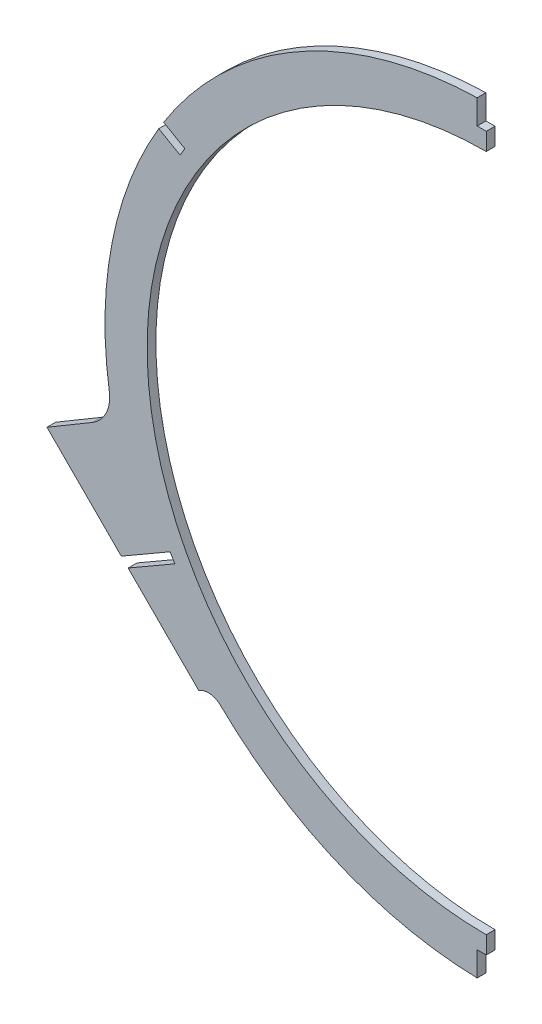
ISO-10303-21;
HEADER;
FILE_DESCRIPTION(('STEP AP214'),'2;1');
FILE_NAME('part.step','',(''),(''),'','','');
FILE_SCHEMA(('AUTOMOTIVE_DESIGN { 1 0 10303 214 1 1 1 1 }'));
ENDSEC;
DATA;
#1=APPLICATION_CONTEXT('core data for automotive mechanical design processes');
#2=APPLICATION_PROTOCOL_DEFINITION('international standard','automotive_design',2000,#1);
#3=PRODUCT_CONTEXT('',#1,'mechanical');
#4=PRODUCT('Part','Part','',(#3));
#5=PRODUCT_RELATED_PRODUCT_CATEGORY('part','',(#4));
#6=PRODUCT_DEFINITION_FORMATION('','',#4);
#7=PRODUCT_DEFINITION_CONTEXT('part definition',#1,'design');
#8=PRODUCT_DEFINITION('design','',#6,#7);
#9=PRODUCT_DEFINITION_SHAPE('','',#8);
#10=(LENGTH_UNIT() NAMED_UNIT(*) SI_UNIT(.MILLI.,.METRE.));
#11=(NAMED_UNIT(*) PLANE_ANGLE_UNIT() SI_UNIT($,.RADIAN.));
#12=(NAMED_UNIT(*) SI_UNIT($,.STERADIAN.) SOLID_ANGLE_UNIT());
#13=UNCERTAINTY_MEASURE_WITH_UNIT(LENGTH_MEASURE(1.E-05),#10,'distance_accuracy_value','');
#14=(GEOMETRIC_REPRESENTATION_CONTEXT(3) GLOBAL_UNCERTAINTY_ASSIGNED_CONTEXT((#13)) GLOBAL_UNIT_ASSIGNED_CONTEXT((#10,
#11,#12)) REPRESENTATION_CONTEXT('',''));
#15=CARTESIAN_POINT('',(0.,0.,0.));
#16=DIRECTION('',(0.,0.,1.));
#17=DIRECTION('',(1.,0.,0.));
#18=AXIS2_PLACEMENT_3D('',#15,#16,#17);
#19=CARTESIAN_POINT('',(0.,12.6999999999999,-1.58750000000003));
#20=DIRECTION('',(0.,0.,1.));
#21=DIRECTION('',(0.,-1.,0.));
#22=AXIS2_PLACEMENT_3D('',#19,#20,#21);
#23=CYLINDRICAL_SURFACE('',#22,137.922);
#24=CARTESIAN_POINT('',(0.,12.6999999999999,1.58749999999997));
#25=DIRECTION('',(0.,0.,-1.));
#26=DIRECTION('',(0.,1.,0.));
#27=AXIS2_PLACEMENT_3D('',#24,#25,#26);
#28=CIRCLE('',#27,137.922);
#29=CARTESIAN_POINT('',(-136.376999489094,-7.88621126753744,1.58749999999997));
#30=VERTEX_POINT('',#29);
#31=CARTESIAN_POINT('',(-118.465901574357,83.327956562361,1.5875));
#32=VERTEX_POINT('',#31);
#33=EDGE_CURVE('E308',#30,#32,#28,.T.);
#34=ORIENTED_EDGE('',*,*,#33,.T.);
#35=DIRECTION('',(0.,0.,1.));
#36=VECTOR('',#35,1.);
#37=CARTESIAN_POINT('',(-118.465901574357,83.327956562361,-1.58750000000003));
#38=LINE('',#37,#36);
#39=CARTESIAN_POINT('',(-118.465901574357,83.327956562361,-1.58750000000003));
#40=VERTEX_POINT('',#39);
#41=EDGE_CURVE('E266',#32,#40,#38,.F.);
#42=ORIENTED_EDGE('',*,*,#41,.T.);
#43=CARTESIAN_POINT('',(0.,12.6999999999999,-1.58750000000003));
#44=DIRECTION('',(0.,0.,-1.));
#45=DIRECTION('',(0.,1.,0.));
#46=AXIS2_PLACEMENT_3D('',#43,#44,#45);
#47=CIRCLE('',#46,137.922);
#48=CARTESIAN_POINT('',(-136.376999489094,-7.88621126753744,-1.58750000000003));
#49=VERTEX_POINT('',#48);
#50=EDGE_CURVE('E304',#49,#40,#47,.T.);
#51=ORIENTED_EDGE('',*,*,#50,.F.);
#52=DIRECTION('',(0.,0.,1.));
#53=VECTOR('',#52,1.);
#54=CARTESIAN_POINT('',(-136.376999489094,-7.88621126753744,-1.58750000000003));
#55=LINE('',#54,#53);
#56=EDGE_CURVE('E327',#49,#30,#55,.T.);
#57=ORIENTED_EDGE('',*,*,#56,.T.);
#58=EDGE_LOOP('',(#34,#42,#51,#57));
#59=FACE_BOUND('',#58,.T.);
#60=ADVANCED_FACE('F36',(#59),#23,.T.);
#61=CARTESIAN_POINT('',(-158.911995310164,-30.4525592107707,1.5875));
#62=DIRECTION('',(0.707823886144249,0.70638894824569,0.));
#63=DIRECTION('',(-0.70638894824569,0.707823886144249,0.));
#64=AXIS2_PLACEMENT_3D('',#61,#62,#63);
#65=PLANE('',#64);
#66=DIRECTION('',(0.706388948245691,-0.707823886144249,0.));
#67=VECTOR('',#66,1.);
#68=CARTESIAN_POINT('',(-158.911995310164,-30.4525592107707,-1.5875));
#69=LINE('',#68,#67);
#70=CARTESIAN_POINT('',(-158.911995310164,-30.4525592107707,-1.5875));
#71=VERTEX_POINT('',#70);
#72=CARTESIAN_POINT('',(-132.026233676687,-57.392935795961,-1.58750000000002));
#73=VERTEX_POINT('',#72);
#74=EDGE_CURVE('E274',#71,#73,#69,.T.);
#75=ORIENTED_EDGE('',*,*,#74,.T.);
#76=DIRECTION('',(0.,0.,1.));
#77=VECTOR('',#76,1.);
#78=CARTESIAN_POINT('',(-132.026233676687,-57.392935795961,1.5875));
#79=LINE('',#78,#77);
#80=CARTESIAN_POINT('',(-132.026233676687,-57.392935795961,1.58750000000001));
#81=VERTEX_POINT('',#80);
#82=EDGE_CURVE('E44',#73,#81,#79,.T.);
#83=ORIENTED_EDGE('',*,*,#82,.T.);
#84=DIRECTION('',(0.706388948245691,-0.707823886144249,0.));
#85=VECTOR('',#84,1.);
#86=CARTESIAN_POINT('',(-158.911995310164,-30.4525592107707,1.5875));
#87=LINE('',#86,#85);
#88=CARTESIAN_POINT('',(-158.911995310164,-30.4525592107707,1.5875));
#89=VERTEX_POINT('',#88);
#90=EDGE_CURVE('E275',#89,#81,#87,.T.);
#91=ORIENTED_EDGE('',*,*,#90,.F.);
#92=DIRECTION('',(0.,0.,-1.));
#93=VECTOR('',#92,1.);
#94=CARTESIAN_POINT('',(-158.911995310164,-30.4525592107707,1.5875));
#95=LINE('',#94,#93);
#96=EDGE_CURVE('E285',#89,#71,#95,.T.);
#97=ORIENTED_EDGE('',*,*,#96,.T.);
#98=EDGE_LOOP('',(#75,#83,#91,#97));
#99=FACE_BOUND('',#98,.T.);
#100=ADVANCED_FACE('F338',(#99),#65,.F.);
#101=CARTESIAN_POINT('',(-116.699944513499,86.2091901366502,1.5875));
#102=VERTEX_POINT('',#101);
#103=CARTESIAN_POINT('',(-3.302,150.58246763095,1.5875));
#104=VERTEX_POINT('',#103);
#105=EDGE_CURVE('E298',#102,#104,#28,.T.);
#106=ORIENTED_EDGE('',*,*,#105,.T.);
#107=DIRECTION('',(0.,0.,1.));
#108=VECTOR('',#107,1.);
#109=CARTESIAN_POINT('',(-3.302,150.58246763095,-1.58750000000004));
#110=LINE('',#109,#108);
#111=CARTESIAN_POINT('',(-3.302,150.58246763095,-1.58750000000004));
#112=VERTEX_POINT('',#111);
#113=EDGE_CURVE('E197',#104,#112,#110,.F.);
#114=ORIENTED_EDGE('',*,*,#113,.T.);
#115=CARTESIAN_POINT('',(-116.699944513499,86.2091901366502,-1.58750000000003));
#116=VERTEX_POINT('',#115);
#117=EDGE_CURVE('E301',#116,#112,#47,.T.);
#118=ORIENTED_EDGE('',*,*,#117,.F.);
#119=DIRECTION('',(0.,0.,1.));
#120=VECTOR('',#119,1.);
#121=CARTESIAN_POINT('',(-116.699944513499,86.2091901366502,-1.58750000000003));
#122=LINE('',#121,#120);
#123=EDGE_CURVE('E263',#116,#102,#122,.T.);
#124=ORIENTED_EDGE('',*,*,#123,.T.);
#125=EDGE_LOOP('',(#106,#114,#118,#124));
#126=FACE_BOUND('',#125,.T.);
#127=ADVANCED_FACE('F394',(#126),#23,.T.);
#128=CARTESIAN_POINT('',(-3.30200000000003,-125.18246763095,-1.58750000000002));
#129=VERTEX_POINT('',#128);
#130=CARTESIAN_POINT('',(-96.1038724994404,-86.2268607336316,-1.58750000000002));
#131=VERTEX_POINT('',#130);
#132=EDGE_CURVE('E306',#129,#131,#47,.T.);
#133=ORIENTED_EDGE('',*,*,#132,.F.);
#134=DIRECTION('',(0.,0.,1.));
#135=VECTOR('',#134,1.);
#136=CARTESIAN_POINT('',(-3.30200000000003,-125.18246763095,-1.58750000000002));
#137=LINE('',#136,#135);
#138=CARTESIAN_POINT('',(-3.30200000000003,-125.18246763095,1.58750000000002));
#139=VERTEX_POINT('',#138);
#140=EDGE_CURVE('E190',#129,#139,#137,.T.);
#141=ORIENTED_EDGE('',*,*,#140,.T.);
#142=CARTESIAN_POINT('',(-96.1038724994404,-86.2268607336316,1.58749999999998));
#143=VERTEX_POINT('',#142);
#144=EDGE_CURVE('E305',#139,#143,#28,.T.);
#145=ORIENTED_EDGE('',*,*,#144,.T.);
#146=DIRECTION('',(0.,0.,1.));
#147=VECTOR('',#146,1.);
#148=CARTESIAN_POINT('',(-96.1038724994404,-86.2268607336316,-1.58750000000002));
#149=LINE('',#148,#147);
#150=EDGE_CURVE('E315',#143,#131,#149,.F.);
#151=ORIENTED_EDGE('',*,*,#150,.T.);
#152=EDGE_LOOP('',(#133,#141,#145,#151));
#153=FACE_BOUND('',#152,.T.);
#154=ADVANCED_FACE('F369',(#153),#23,.T.);
#155=CARTESIAN_POINT('',(0.,12.6999999999999,-1.58750000000003));
#156=DIRECTION('',(0.,0.,-1.));
#157=DIRECTION('',(0.,1.,0.));
#158=AXIS2_PLACEMENT_3D('',#155,#156,#157);
#159=PLANE('',#158);
#160=DIRECTION('',(0.,1.,0.));
#161=VECTOR('',#160,1.);
#162=CARTESIAN_POINT('',(-3.302,141.732,-1.58750000000004));
#163=LINE('',#162,#161);
#164=CARTESIAN_POINT('',(-3.302,141.732,-1.58750000000004));
#165=VERTEX_POINT('',#164);
#166=EDGE_CURVE('E209',#165,#112,#163,.T.);
#167=ORIENTED_EDGE('',*,*,#166,.F.);
#168=DIRECTION('',(-1.,0.,0.));
#169=VECTOR('',#168,1.);
#170=CARTESIAN_POINT('',(0.,141.732,-1.58750000000004));
#171=LINE('',#170,#169);
#172=CARTESIAN_POINT('',(0.,141.732,-1.58750000000004));
#173=VERTEX_POINT('',#172);
#174=EDGE_CURVE('E187',#173,#165,#171,.T.);
#175=ORIENTED_EDGE('',*,*,#174,.F.);
#176=DIRECTION('',(0.,-1.,0.));
#177=VECTOR('',#176,1.);
#178=CARTESIAN_POINT('',(0.,12.6999999999999,-1.58750000000003));
#179=LINE('',#178,#177);
#180=CARTESIAN_POINT('',(0.,135.382,-1.58750000000003));
#181=VERTEX_POINT('',#180);
#182=EDGE_CURVE('E294',#173,#181,#179,.T.);
#183=ORIENTED_EDGE('',*,*,#182,.T.);
#184=CARTESIAN_POINT('',(0.,12.6999999999999,-1.58750000000003));
#185=DIRECTION('',(0.,0.,-1.));
#186=DIRECTION('',(0.,1.,0.));
#187=AXIS2_PLACEMENT_3D('',#184,#185,#186);
#188=CIRCLE('',#187,122.682);
#189=CARTESIAN_POINT('',(0.,-109.982,-1.58750000000002));
#190=VERTEX_POINT('',#189);
#191=EDGE_CURVE('E295',#190,#181,#188,.T.);
#192=ORIENTED_EDGE('',*,*,#191,.F.);
#193=CARTESIAN_POINT('',(0.,-116.332,-1.58750000000002));
#194=VERTEX_POINT('',#193);
#195=EDGE_CURVE('E291',#190,#194,#179,.T.);
#196=ORIENTED_EDGE('',*,*,#195,.T.);
#197=DIRECTION('',(1.,0.,0.));
#198=VECTOR('',#197,1.);
#199=CARTESIAN_POINT('',(0.,-116.332,-1.58750000000002));
#200=LINE('',#199,#198);
#201=CARTESIAN_POINT('',(-3.302,-116.332,-1.58750000000002));
#202=VERTEX_POINT('',#201);
#203=EDGE_CURVE('E59',#202,#194,#200,.T.);
#204=ORIENTED_EDGE('',*,*,#203,.F.);
#205=DIRECTION('',(0.,1.,0.));
#206=VECTOR('',#205,1.);
#207=CARTESIAN_POINT('',(-3.302,-116.332,-1.58750000000002));
#208=LINE('',#207,#206);
#209=EDGE_CURVE('E211',#129,#202,#208,.T.);
#210=ORIENTED_EDGE('',*,*,#209,.F.);
#211=ORIENTED_EDGE('',*,*,#132,.T.);
#212=CARTESIAN_POINT('',(-100.528544345639,-90.7815044138172,-1.58750000000002));
#213=DIRECTION('',(0.,0.,-1.));
#214=DIRECTION('',(0.,1.,0.));
#215=AXIS2_PLACEMENT_3D('',#212,#213,#214);
#216=CIRCLE('',#215,6.35);
#217=CARTESIAN_POINT('',(-104.007060596074,-85.4690262072306,-1.5875));
#218=VERTEX_POINT('',#217);
#219=EDGE_CURVE('E318',#131,#218,#216,.F.);
#220=ORIENTED_EDGE('',*,*,#219,.T.);
#221=CARTESIAN_POINT('',(-129.556400382485,-59.8677862374526,-1.5875));
#222=VERTEX_POINT('',#221);
#223=EDGE_CURVE('E280',#222,#218,#69,.T.);
#224=ORIENTED_EDGE('',*,*,#223,.F.);
#225=DIRECTION('',(-0.86602540378444,-0.499999999999998,0.));
#226=VECTOR('',#225,1.);
#227=CARTESIAN_POINT('',(-112.665009205345,-50.1155369943436,-1.58750000000002));
#228=LINE('',#227,#226);
#229=CARTESIAN_POINT('',(-112.665009205345,-50.1155369943436,-1.58750000000002));
#230=VERTEX_POINT('',#229);
#231=EDGE_CURVE('E219',#230,#222,#228,.T.);
#232=ORIENTED_EDGE('',*,*,#231,.F.);
#233=DIRECTION('',(0.499999999999998,-0.86602540378444,0.));
#234=VECTOR('',#233,1.);
#235=CARTESIAN_POINT('',(-112.665009205345,-50.1155369943436,-1.58750000000002));
#236=LINE('',#235,#234);
#237=CARTESIAN_POINT('',(-114.354109205345,-47.189929975279,-1.58750000000003));
#238=VERTEX_POINT('',#237);
#239=EDGE_CURVE('E221',#238,#230,#236,.T.);
#240=ORIENTED_EDGE('',*,*,#239,.F.);
#241=DIRECTION('',(0.86602540378444,0.499999999999997,0.));
#242=VECTOR('',#241,1.);
#243=CARTESIAN_POINT('',(-114.354109205345,-47.189929975279,-1.58750000000003));
#244=LINE('',#243,#242);
#245=EDGE_CURVE('E225',#73,#238,#244,.T.);
#246=ORIENTED_EDGE('',*,*,#245,.F.);
#247=ORIENTED_EDGE('',*,*,#74,.F.);
#248=DIRECTION('',(-0.860386484927819,-0.509642125960514,0.));
#249=VECTOR('',#248,1.);
#250=CARTESIAN_POINT('',(-134.859098706398,-16.2050441981659,-1.5875));
#251=LINE('',#250,#249);
#252=CARTESIAN_POINT('',(-142.46227924898,-20.7087191903507,-1.5875));
#253=VERTEX_POINT('',#252);
#254=EDGE_CURVE('E270',#253,#71,#251,.T.);
#255=ORIENTED_EDGE('',*,*,#254,.F.);
#256=CARTESIAN_POINT('',(-148.934734248679,-9.78181083176739,-1.58750000000003));
#257=DIRECTION('',(0.,0.,-1.));
#258=DIRECTION('',(0.,1.,0.));
#259=AXIS2_PLACEMENT_3D('',#256,#257,#258);
#260=CIRCLE('',#259,12.7);
#261=EDGE_CURVE('E329',#253,#49,#260,.F.);
#262=ORIENTED_EDGE('',*,*,#261,.T.);
#263=ORIENTED_EDGE('',*,*,#50,.T.);
#264=DIRECTION('',(-0.866025403784437,0.500000000000002,0.));
#265=VECTOR('',#264,1.);
#266=CARTESIAN_POINT('',(-110.732355392135,78.8629915922646,-1.58750000000003));
#267=LINE('',#266,#265);
#268=CARTESIAN_POINT('',(-110.732355392135,78.8629915922646,-1.58750000000003));
#269=VERTEX_POINT('',#268);
#270=EDGE_CURVE('E240',#269,#40,#267,.T.);
#271=ORIENTED_EDGE('',*,*,#270,.F.);
#272=DIRECTION('',(-0.500000000000004,-0.866025403784436,0.));
#273=VECTOR('',#272,1.);
#274=CARTESIAN_POINT('',(-109.043255392135,81.7885986113291,-1.58750000000003));
#275=LINE('',#274,#273);
#276=CARTESIAN_POINT('',(-109.043255392135,81.7885986113291,-1.58750000000003));
#277=VERTEX_POINT('',#276);
#278=EDGE_CURVE('E251',#277,#269,#275,.T.);
#279=ORIENTED_EDGE('',*,*,#278,.F.);
#280=DIRECTION('',(0.866025403784438,-0.500000000000002,0.));
#281=VECTOR('',#280,1.);
#282=CARTESIAN_POINT('',(-109.043255392135,81.7885986113291,-1.58750000000003));
#283=LINE('',#282,#281);
#284=EDGE_CURVE('E254',#116,#277,#283,.T.);
#285=ORIENTED_EDGE('',*,*,#284,.F.);
#286=ORIENTED_EDGE('',*,*,#117,.T.);
#287=EDGE_LOOP('',(#167,#175,#183,#192,#196,#204,#210,#211,#220,#224,#232,#240,#246,#247,#255,
#262,#263,#271,#279,#285,#286));
#288=FACE_BOUND('',#287,.T.);
#289=ADVANCED_FACE('F355',(#288),#159,.T.);
#290=CARTESIAN_POINT('',(0.,12.6999999999999,1.58749999999997));
#291=DIRECTION('',(0.,0.,-1.));
#292=DIRECTION('',(0.,1.,0.));
#293=AXIS2_PLACEMENT_3D('',#290,#291,#292);
#294=PLANE('',#293);
#295=DIRECTION('',(-1.,0.,0.));
#296=VECTOR('',#295,1.);
#297=CARTESIAN_POINT('',(0.,141.732,1.5875));
#298=LINE('',#297,#296);
#299=CARTESIAN_POINT('',(0.,141.732,1.58749999999996));
#300=VERTEX_POINT('',#299);
#301=CARTESIAN_POINT('',(-3.302,141.732,1.5875));
#302=VERTEX_POINT('',#301);
#303=EDGE_CURVE('E184',#300,#302,#298,.T.);
#304=ORIENTED_EDGE('',*,*,#303,.T.);
#305=DIRECTION('',(0.,1.,0.));
#306=VECTOR('',#305,1.);
#307=CARTESIAN_POINT('',(-3.302,141.732,1.5875));
#308=LINE('',#307,#306);
#309=EDGE_CURVE('E194',#302,#104,#308,.T.);
#310=ORIENTED_EDGE('',*,*,#309,.T.);
#311=ORIENTED_EDGE('',*,*,#105,.F.);
#312=DIRECTION('',(0.866025403784438,-0.500000000000002,0.));
#313=VECTOR('',#312,1.);
#314=CARTESIAN_POINT('',(2.6554269066049,17.299334318025,1.58749999999997));
#315=LINE('',#314,#313);
#316=CARTESIAN_POINT('',(-109.043255392135,81.7885986113292,1.58749999999997));
#317=VERTEX_POINT('',#316);
#318=EDGE_CURVE('E11',#102,#317,#315,.T.);
#319=ORIENTED_EDGE('',*,*,#318,.T.);
#320=DIRECTION('',(-0.500000000000004,-0.866025403784436,0.));
#321=VECTOR('',#320,1.);
#322=CARTESIAN_POINT('',(-109.043255392135,81.7885986113291,1.5875));
#323=LINE('',#322,#321);
#324=CARTESIAN_POINT('',(-110.732355392135,78.8629915922646,1.5875));
#325=VERTEX_POINT('',#324);
#326=EDGE_CURVE('E51',#317,#325,#323,.T.);
#327=ORIENTED_EDGE('',*,*,#326,.T.);
#328=DIRECTION('',(-0.866025403784437,0.500000000000002,0.));
#329=VECTOR('',#328,1.);
#330=CARTESIAN_POINT('',(-110.732355392135,78.8629915922646,1.5875));
#331=LINE('',#330,#329);
#332=EDGE_CURVE('E255',#325,#32,#331,.T.);
#333=ORIENTED_EDGE('',*,*,#332,.T.);
#334=ORIENTED_EDGE('',*,*,#33,.F.);
#335=CARTESIAN_POINT('',(-148.934734248679,-9.78181083176739,1.58749999999997));
#336=DIRECTION('',(0.,0.,-1.));
#337=DIRECTION('',(0.,1.,0.));
#338=AXIS2_PLACEMENT_3D('',#335,#336,#337);
#339=CIRCLE('',#338,12.7);
#340=CARTESIAN_POINT('',(-142.46227924898,-20.7087191903507,1.5875));
#341=VERTEX_POINT('',#340);
#342=EDGE_CURVE('E331',#30,#341,#339,.T.);
#343=ORIENTED_EDGE('',*,*,#342,.T.);
#344=DIRECTION('',(-0.860386484927819,-0.509642125960514,0.));
#345=VECTOR('',#344,1.);
#346=CARTESIAN_POINT('',(-134.859098706398,-16.2050441981659,1.5875));
#347=LINE('',#346,#345);
#348=EDGE_CURVE('E271',#341,#89,#347,.T.);
#349=ORIENTED_EDGE('',*,*,#348,.T.);
#350=ORIENTED_EDGE('',*,*,#90,.T.);
#351=DIRECTION('',(0.86602540378444,0.499999999999997,0.));
#352=VECTOR('',#351,1.);
#353=CARTESIAN_POINT('',(-114.354109205345,-47.189929975279,1.58750000000001));
#354=LINE('',#353,#352);
#355=CARTESIAN_POINT('',(-114.354109205345,-47.189929975279,1.58750000000001));
#356=VERTEX_POINT('',#355);
#357=EDGE_CURVE('E222',#81,#356,#354,.T.);
#358=ORIENTED_EDGE('',*,*,#357,.T.);
#359=DIRECTION('',(0.499999999999998,-0.86602540378444,0.));
#360=VECTOR('',#359,1.);
#361=CARTESIAN_POINT('',(-112.665009205345,-50.1155369943436,1.58750000000001));
#362=LINE('',#361,#360);
#363=CARTESIAN_POINT('',(-112.665009205345,-50.1155369943436,1.58750000000001));
#364=VERTEX_POINT('',#363);
#365=EDGE_CURVE('E230',#356,#364,#362,.T.);
#366=ORIENTED_EDGE('',*,*,#365,.T.);
#367=DIRECTION('',(-0.86602540378444,-0.499999999999998,0.));
#368=VECTOR('',#367,1.);
#369=CARTESIAN_POINT('',(-112.665009205345,-50.1155369943436,1.58750000000001));
#370=LINE('',#369,#368);
#371=CARTESIAN_POINT('',(-129.556400382485,-59.8677862374526,1.58750000000001));
#372=VERTEX_POINT('',#371);
#373=EDGE_CURVE('E216',#364,#372,#370,.T.);
#374=ORIENTED_EDGE('',*,*,#373,.T.);
#375=CARTESIAN_POINT('',(-104.007060596074,-85.4690262072306,1.5875));
#376=VERTEX_POINT('',#375);
#377=EDGE_CURVE('E273',#372,#376,#87,.T.);
#378=ORIENTED_EDGE('',*,*,#377,.T.);
#379=CARTESIAN_POINT('',(-100.528544345639,-90.7815044138172,1.58749999999998));
#380=DIRECTION('',(0.,0.,-1.));
#381=DIRECTION('',(0.,1.,0.));
#382=AXIS2_PLACEMENT_3D('',#379,#380,#381);
#383=CIRCLE('',#382,6.35);
#384=EDGE_CURVE('E321',#376,#143,#383,.T.);
#385=ORIENTED_EDGE('',*,*,#384,.T.);
#386=ORIENTED_EDGE('',*,*,#144,.F.);
#387=DIRECTION('',(0.,1.,0.));
#388=VECTOR('',#387,1.);
#389=CARTESIAN_POINT('',(-3.302,-116.332,1.58750000000002));
#390=LINE('',#389,#388);
#391=CARTESIAN_POINT('',(-3.302,-116.332,1.58750000000002));
#392=VERTEX_POINT('',#391);
#393=EDGE_CURVE('E242',#139,#392,#390,.T.);
#394=ORIENTED_EDGE('',*,*,#393,.T.);
#395=DIRECTION('',(1.,0.,0.));
#396=VECTOR('',#395,1.);
#397=CARTESIAN_POINT('',(0.,-116.332,1.58750000000002));
#398=LINE('',#397,#396);
#399=CARTESIAN_POINT('',(0.,-116.332,1.58750000000002));
#400=VERTEX_POINT('',#399);
#401=EDGE_CURVE('E237',#392,#400,#398,.T.);
#402=ORIENTED_EDGE('',*,*,#401,.T.);
#403=DIRECTION('',(0.,-1.,0.));
#404=VECTOR('',#403,1.);
#405=CARTESIAN_POINT('',(0.,12.6999999999999,1.58749999999997));
#406=LINE('',#405,#404);
#407=CARTESIAN_POINT('',(0.,-109.982,1.58749999999997));
#408=VERTEX_POINT('',#407);
#409=EDGE_CURVE('E288',#408,#400,#406,.T.);
#410=ORIENTED_EDGE('',*,*,#409,.F.);
#411=CARTESIAN_POINT('',(0.,12.6999999999999,1.58749999999997));
#412=DIRECTION('',(0.,0.,-1.));
#413=DIRECTION('',(0.,1.,0.));
#414=AXIS2_PLACEMENT_3D('',#411,#412,#413);
#415=CIRCLE('',#414,122.682);
#416=CARTESIAN_POINT('',(0.,135.382,1.58749999999997));
#417=VERTEX_POINT('',#416);
#418=EDGE_CURVE('E299',#408,#417,#415,.T.);
#419=ORIENTED_EDGE('',*,*,#418,.T.);
#420=EDGE_CURVE('E205',#300,#417,#406,.T.);
#421=ORIENTED_EDGE('',*,*,#420,.F.);
#422=EDGE_LOOP('',(#304,#310,#311,#319,#327,#333,#334,#343,#349,#350,#358,#366,#374,#378,#385,
#386,#394,#402,#410,#419,#421));
#423=FACE_BOUND('',#422,.T.);
#424=ADVANCED_FACE('F203',(#423),#294,.F.);
#425=CARTESIAN_POINT('',(0.,12.6999999999999,-1.58750000000003));
#426=DIRECTION('',(0.,0.,1.));
#427=DIRECTION('',(0.,-1.,0.));
#428=AXIS2_PLACEMENT_3D('',#425,#426,#427);
#429=CYLINDRICAL_SURFACE('',#428,122.682);
#430=ORIENTED_EDGE('',*,*,#191,.T.);
#431=DIRECTION('',(0.,0.,1.));
#432=VECTOR('',#431,1.);
#433=CARTESIAN_POINT('',(0.,135.382,-1.58750000000003));
#434=LINE('',#433,#432);
#435=EDGE_CURVE('E312',#181,#417,#434,.T.);
#436=ORIENTED_EDGE('',*,*,#435,.T.);
#437=ORIENTED_EDGE('',*,*,#418,.F.);
#438=DIRECTION('',(0.,0.,1.));
#439=VECTOR('',#438,1.);
#440=CARTESIAN_POINT('',(0.,-109.982,-1.58750000000002));
#441=LINE('',#440,#439);
#442=EDGE_CURVE('E309',#408,#190,#441,.F.);
#443=ORIENTED_EDGE('',*,*,#442,.T.);
#444=EDGE_LOOP('',(#430,#436,#437,#443));
#445=FACE_BOUND('',#444,.T.);
#446=ADVANCED_FACE('F433',(#445),#429,.F.);
#447=CARTESIAN_POINT('',(0.,0.,0.));
#448=DIRECTION('',(1.,0.,0.));
#449=DIRECTION('',(0.,0.,-1.));
#450=AXIS2_PLACEMENT_3D('',#447,#448,#449);
#451=PLANE('',#450);
#452=DIRECTION('',(0.,0.,-1.));
#453=VECTOR('',#452,1.);
#454=CARTESIAN_POINT('',(0.,-116.332,1.58750000000002));
#455=LINE('',#454,#453);
#456=EDGE_CURVE('E238',#400,#194,#455,.T.);
#457=ORIENTED_EDGE('',*,*,#456,.T.);
#458=ORIENTED_EDGE('',*,*,#195,.F.);
#459=ORIENTED_EDGE('',*,*,#442,.F.);
#460=ORIENTED_EDGE('',*,*,#409,.T.);
#461=EDGE_LOOP('',(#457,#458,#459,#460));
#462=FACE_BOUND('',#461,.T.);
#463=ADVANCED_FACE('F431',(#462),#451,.T.);
#464=DIRECTION('',(0.,0.,-1.));
#465=VECTOR('',#464,1.);
#466=CARTESIAN_POINT('',(0.,141.732,1.5875));
#467=LINE('',#466,#465);
#468=EDGE_CURVE('E191',#300,#173,#467,.T.);
#469=ORIENTED_EDGE('',*,*,#468,.F.);
#470=ORIENTED_EDGE('',*,*,#420,.T.);
#471=ORIENTED_EDGE('',*,*,#435,.F.);
#472=ORIENTED_EDGE('',*,*,#182,.F.);
#473=EDGE_LOOP('',(#469,#470,#471,#472));
#474=FACE_BOUND('',#473,.T.);
#475=ADVANCED_FACE('F428',(#474),#451,.T.);
#476=CARTESIAN_POINT('',(-134.859098706398,-16.2050441981659,1.5875));
#477=DIRECTION('',(0.509642125960514,-0.860386484927819,0.));
#478=DIRECTION('',(0.860386484927819,0.509642125960514,0.));
#479=AXIS2_PLACEMENT_3D('',#476,#477,#478);
#480=PLANE('',#479);
#481=ORIENTED_EDGE('',*,*,#348,.F.);
#482=DIRECTION('',(0.,0.,-1.));
#483=VECTOR('',#482,1.);
#484=CARTESIAN_POINT('',(-142.46227924898,-20.7087191903507,-1.58750000000003));
#485=LINE('',#484,#483);
#486=EDGE_CURVE('E324',#341,#253,#485,.T.);
#487=ORIENTED_EDGE('',*,*,#486,.T.);
#488=ORIENTED_EDGE('',*,*,#254,.T.);
#489=ORIENTED_EDGE('',*,*,#96,.F.);
#490=EDGE_LOOP('',(#481,#487,#488,#489));
#491=FACE_BOUND('',#490,.T.);
#492=ADVANCED_FACE('F348',(#491),#480,.F.);
#493=ORIENTED_EDGE('',*,*,#377,.F.);
#494=DIRECTION('',(0.,0.,-1.));
#495=VECTOR('',#494,1.);
#496=CARTESIAN_POINT('',(-129.556400382485,-59.8677862374526,1.5875));
#497=LINE('',#496,#495);
#498=EDGE_CURVE('E333',#372,#222,#497,.T.);
#499=ORIENTED_EDGE('',*,*,#498,.T.);
#500=ORIENTED_EDGE('',*,*,#223,.T.);
#501=DIRECTION('',(0.,0.,-1.));
#502=VECTOR('',#501,1.);
#503=CARTESIAN_POINT('',(-104.007060596074,-85.4690262072306,1.5875));
#504=LINE('',#503,#502);
#505=EDGE_CURVE('E278',#376,#218,#504,.T.);
#506=ORIENTED_EDGE('',*,*,#505,.F.);
#507=EDGE_LOOP('',(#493,#499,#500,#506));
#508=FACE_BOUND('',#507,.T.);
#509=ADVANCED_FACE('F374',(#508),#65,.F.);
#510=CARTESIAN_POINT('',(-100.528544345639,-90.7815044138172,1.5875));
#511=DIRECTION('',(0.,0.,1.));
#512=DIRECTION('',(0.,-1.,0.));
#513=AXIS2_PLACEMENT_3D('',#510,#511,#512);
#514=CYLINDRICAL_SURFACE('',#513,6.35);
#515=ORIENTED_EDGE('',*,*,#384,.F.);
#516=ORIENTED_EDGE('',*,*,#505,.T.);
#517=ORIENTED_EDGE('',*,*,#219,.F.);
#518=ORIENTED_EDGE('',*,*,#150,.F.);
#519=EDGE_LOOP('',(#515,#516,#517,#518));
#520=FACE_BOUND('',#519,.T.);
#521=ADVANCED_FACE('F367',(#520),#514,.F.);
#522=CARTESIAN_POINT('',(-148.934734248679,-9.78181083176739,-1.58750000000002));
#523=DIRECTION('',(0.,0.,1.));
#524=DIRECTION('',(0.,-1.,0.));
#525=AXIS2_PLACEMENT_3D('',#522,#523,#524);
#526=CYLINDRICAL_SURFACE('',#525,12.7);
#527=ORIENTED_EDGE('',*,*,#342,.F.);
#528=ORIENTED_EDGE('',*,*,#56,.F.);
#529=ORIENTED_EDGE('',*,*,#261,.F.);
#530=ORIENTED_EDGE('',*,*,#486,.F.);
#531=EDGE_LOOP('',(#527,#528,#529,#530));
#532=FACE_BOUND('',#531,.T.);
#533=ADVANCED_FACE('F38',(#532),#526,.F.);
#534=CARTESIAN_POINT('',(-114.354109205345,-47.189929975279,1.58750000000001));
#535=DIRECTION('',(-0.499999999999997,0.86602540378444,0.));
#536=DIRECTION('',(-0.86602540378444,-0.499999999999997,0.));
#537=AXIS2_PLACEMENT_3D('',#534,#535,#536);
#538=PLANE('',#537);
#539=ORIENTED_EDGE('',*,*,#245,.T.);
#540=DIRECTION('',(0.,0.,-1.));
#541=VECTOR('',#540,1.);
#542=CARTESIAN_POINT('',(-114.354109205345,-47.189929975279,1.58750000000001));
#543=LINE('',#542,#541);
#544=EDGE_CURVE('E213',#356,#238,#543,.T.);
#545=ORIENTED_EDGE('',*,*,#544,.F.);
#546=ORIENTED_EDGE('',*,*,#357,.F.);
#547=ORIENTED_EDGE('',*,*,#82,.F.);
#548=EDGE_LOOP('',(#539,#545,#546,#547));
#549=FACE_BOUND('',#548,.T.);
#550=ADVANCED_FACE('F382',(#549),#538,.F.);
#551=CARTESIAN_POINT('',(-112.665009205345,-50.1155369943436,1.58750000000001));
#552=DIRECTION('',(0.499999999999998,-0.86602540378444,0.));
#553=DIRECTION('',(0.86602540378444,0.499999999999998,0.));
#554=AXIS2_PLACEMENT_3D('',#551,#552,#553);
#555=PLANE('',#554);
#556=ORIENTED_EDGE('',*,*,#373,.F.);
#557=DIRECTION('',(0.,0.,-1.));
#558=VECTOR('',#557,1.);
#559=CARTESIAN_POINT('',(-112.665009205345,-50.1155369943436,1.58750000000001));
#560=LINE('',#559,#558);
#561=EDGE_CURVE('E217',#364,#230,#560,.T.);
#562=ORIENTED_EDGE('',*,*,#561,.T.);
#563=ORIENTED_EDGE('',*,*,#231,.T.);
#564=ORIENTED_EDGE('',*,*,#498,.F.);
#565=EDGE_LOOP('',(#556,#562,#563,#564));
#566=FACE_BOUND('',#565,.T.);
#567=ADVANCED_FACE('F378',(#566),#555,.F.);
#568=CARTESIAN_POINT('',(-112.665009205345,-50.1155369943436,1.58750000000001));
#569=DIRECTION('',(0.86602540378444,0.499999999999998,0.));
#570=DIRECTION('',(-0.499999999999998,0.86602540378444,0.));
#571=AXIS2_PLACEMENT_3D('',#568,#569,#570);
#572=PLANE('',#571);
#573=ORIENTED_EDGE('',*,*,#239,.T.);
#574=ORIENTED_EDGE('',*,*,#561,.F.);
#575=ORIENTED_EDGE('',*,*,#365,.F.);
#576=ORIENTED_EDGE('',*,*,#544,.T.);
#577=EDGE_LOOP('',(#573,#574,#575,#576));
#578=FACE_BOUND('',#577,.T.);
#579=ADVANCED_FACE('F381',(#578),#572,.F.);
#580=CARTESIAN_POINT('',(-3.302,141.732,1.5875));
#581=DIRECTION('',(-1.,0.,0.));
#582=DIRECTION('',(0.,0.,1.));
#583=AXIS2_PLACEMENT_3D('',#580,#581,#582);
#584=PLANE('',#583);
#585=ORIENTED_EDGE('',*,*,#309,.F.);
#586=DIRECTION('',(0.,0.,-1.));
#587=VECTOR('',#586,1.);
#588=CARTESIAN_POINT('',(-3.302,141.732,1.5875));
#589=LINE('',#588,#587);
#590=EDGE_CURVE('E180',#302,#165,#589,.T.);
#591=ORIENTED_EDGE('',*,*,#590,.T.);
#592=ORIENTED_EDGE('',*,*,#166,.T.);
#593=ORIENTED_EDGE('',*,*,#113,.F.);
#594=EDGE_LOOP('',(#585,#591,#592,#593));
#595=FACE_BOUND('',#594,.T.);
#596=ADVANCED_FACE('F195',(#595),#584,.F.);
#597=CARTESIAN_POINT('',(0.,141.732,1.5875));
#598=DIRECTION('',(0.,-1.,0.));
#599=DIRECTION('',(0.,0.,-1.));
#600=AXIS2_PLACEMENT_3D('',#597,#598,#599);
#601=PLANE('',#600);
#602=ORIENTED_EDGE('',*,*,#174,.T.);
#603=ORIENTED_EDGE('',*,*,#590,.F.);
#604=ORIENTED_EDGE('',*,*,#303,.F.);
#605=ORIENTED_EDGE('',*,*,#468,.T.);
#606=EDGE_LOOP('',(#602,#603,#604,#605));
#607=FACE_BOUND('',#606,.T.);
#608=ADVANCED_FACE('F182',(#607),#601,.F.);
#609=CARTESIAN_POINT('',(-3.302,-116.332,1.58750000000002));
#610=DIRECTION('',(-1.,0.,0.));
#611=DIRECTION('',(0.,-1.,0.));
#612=AXIS2_PLACEMENT_3D('',#609,#610,#611);
#613=PLANE('',#612);
#614=ORIENTED_EDGE('',*,*,#209,.T.);
#615=DIRECTION('',(0.,0.,-1.));
#616=VECTOR('',#615,1.);
#617=CARTESIAN_POINT('',(-3.302,-116.332,1.58750000000002));
#618=LINE('',#617,#616);
#619=EDGE_CURVE('E235',#392,#202,#618,.T.);
#620=ORIENTED_EDGE('',*,*,#619,.F.);
#621=ORIENTED_EDGE('',*,*,#393,.F.);
#622=ORIENTED_EDGE('',*,*,#140,.F.);
#623=EDGE_LOOP('',(#614,#620,#621,#622));
#624=FACE_BOUND('',#623,.T.);
#625=ADVANCED_FACE('F584',(#624),#613,.F.);
#626=CARTESIAN_POINT('',(0.,-116.332,1.58750000000002));
#627=DIRECTION('',(0.,1.,0.));
#628=DIRECTION('',(0.,0.,1.));
#629=AXIS2_PLACEMENT_3D('',#626,#627,#628);
#630=PLANE('',#629);
#631=ORIENTED_EDGE('',*,*,#203,.T.);
#632=ORIENTED_EDGE('',*,*,#456,.F.);
#633=ORIENTED_EDGE('',*,*,#401,.F.);
#634=ORIENTED_EDGE('',*,*,#619,.T.);
#635=EDGE_LOOP('',(#631,#632,#633,#634));
#636=FACE_BOUND('',#635,.T.);
#637=ADVANCED_FACE('F421',(#636),#630,.F.);
#638=CARTESIAN_POINT('',(-110.732355392135,78.8629915922646,1.5875));
#639=DIRECTION('',(-0.500000000000003,-0.866025403784437,0.));
#640=DIRECTION('',(0.866025403784437,-0.500000000000003,0.));
#641=AXIS2_PLACEMENT_3D('',#638,#639,#640);
#642=PLANE('',#641);
#643=ORIENTED_EDGE('',*,*,#332,.F.);
#644=DIRECTION('',(0.,0.,-1.));
#645=VECTOR('',#644,1.);
#646=CARTESIAN_POINT('',(-110.732355392135,78.8629915922646,1.5875));
#647=LINE('',#646,#645);
#648=EDGE_CURVE('E227',#325,#269,#647,.T.);
#649=ORIENTED_EDGE('',*,*,#648,.T.);
#650=ORIENTED_EDGE('',*,*,#270,.T.);
#651=ORIENTED_EDGE('',*,*,#41,.F.);
#652=EDGE_LOOP('',(#643,#649,#650,#651));
#653=FACE_BOUND('',#652,.T.);
#654=ADVANCED_FACE('F408',(#653),#642,.F.);
#655=CARTESIAN_POINT('',(-109.043255392135,81.7885986113291,1.5875));
#656=DIRECTION('',(0.500000000000002,0.866025403784438,0.));
#657=DIRECTION('',(-0.866025403784438,0.500000000000002,0.));
#658=AXIS2_PLACEMENT_3D('',#655,#656,#657);
#659=PLANE('',#658);
#660=ORIENTED_EDGE('',*,*,#284,.T.);
#661=DIRECTION('',(0.,0.,-1.));
#662=VECTOR('',#661,1.);
#663=CARTESIAN_POINT('',(-109.043255392135,81.7885986113291,1.5875));
#664=LINE('',#663,#662);
#665=EDGE_CURVE('E248',#317,#277,#664,.T.);
#666=ORIENTED_EDGE('',*,*,#665,.F.);
#667=ORIENTED_EDGE('',*,*,#318,.F.);
#668=ORIENTED_EDGE('',*,*,#123,.F.);
#669=EDGE_LOOP('',(#660,#666,#667,#668));
#670=FACE_BOUND('',#669,.T.);
#671=ADVANCED_FACE('F413',(#670),#659,.F.);
#672=CARTESIAN_POINT('',(-109.043255392135,81.7885986113291,1.5875));
#673=DIRECTION('',(0.866025403784436,-0.500000000000004,0.));
#674=DIRECTION('',(0.500000000000004,0.866025403784436,0.));
#675=AXIS2_PLACEMENT_3D('',#672,#673,#674);
#676=PLANE('',#675);
#677=ORIENTED_EDGE('',*,*,#278,.T.);
#678=ORIENTED_EDGE('',*,*,#648,.F.);
#679=ORIENTED_EDGE('',*,*,#326,.F.);
#680=ORIENTED_EDGE('',*,*,#665,.T.);
#681=EDGE_LOOP('',(#677,#678,#679,#680));
#682=FACE_BOUND('',#681,.T.);
#683=ADVANCED_FACE('F411',(#682),#676,.F.);
#684=CLOSED_SHELL('',(#60,#100,#127,#154,#289,#424,#446,#463,#475,#492,#509,#521,#533,#550,#567,
#579,#596,#608,#625,#637,#654,#671,#683));
#685=MANIFOLD_SOLID_BREP('B2',#684);
#686=ADVANCED_BREP_SHAPE_REPRESENTATION('',(#18,#685),#14);
#687=SHAPE_DEFINITION_REPRESENTATION(#9,#686);
ENDSEC;
END-ISO-10303-21;
